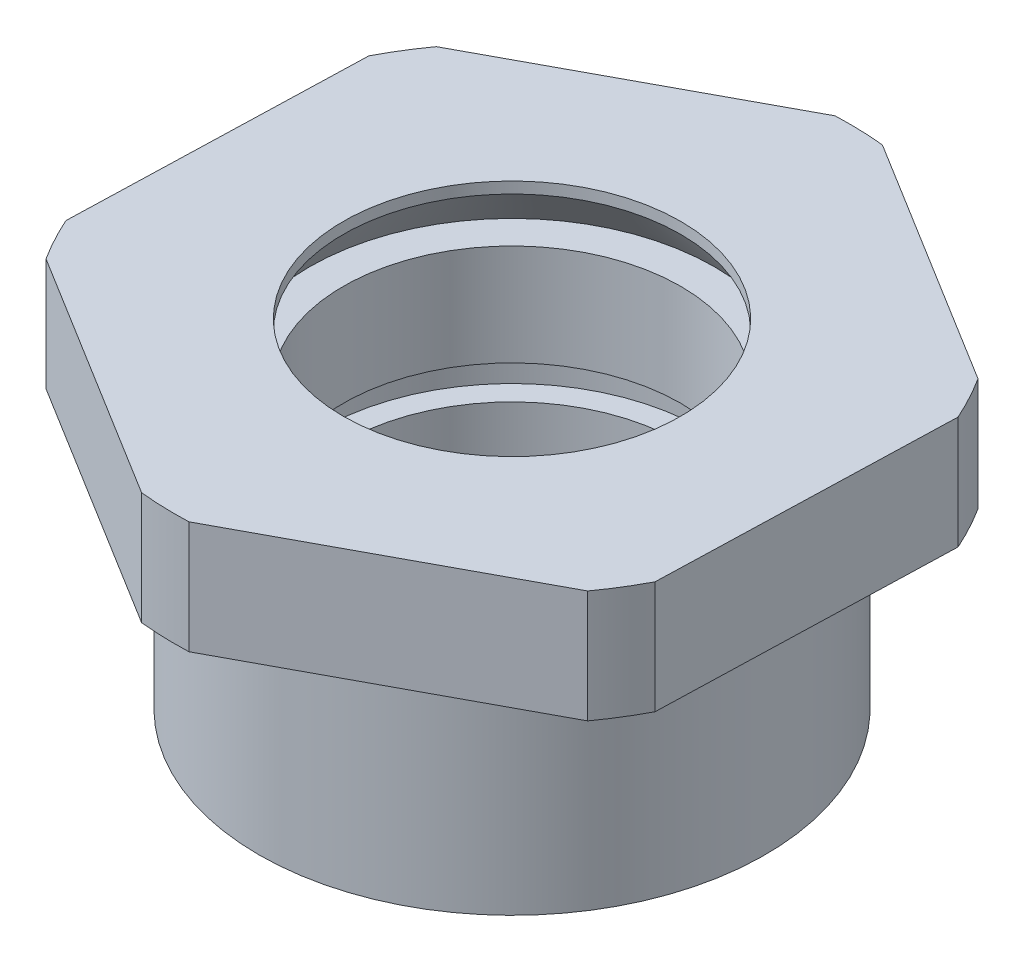
ISO-10303-21;
HEADER;
FILE_DESCRIPTION(('STEP AP214'),'2;1');
FILE_NAME('part.step','',(''),(''),'','','');
FILE_SCHEMA(('AUTOMOTIVE_DESIGN { 1 0 10303 214 1 1 1 1 }'));
ENDSEC;
DATA;
#1=APPLICATION_CONTEXT('core data for automotive mechanical design processes');
#2=APPLICATION_PROTOCOL_DEFINITION('international standard','automotive_design',2000,#1);
#3=PRODUCT_CONTEXT('',#1,'mechanical');
#4=PRODUCT('Part','Part','',(#3));
#5=PRODUCT_RELATED_PRODUCT_CATEGORY('part','',(#4));
#6=PRODUCT_DEFINITION_FORMATION('','',#4);
#7=PRODUCT_DEFINITION_CONTEXT('part definition',#1,'design');
#8=PRODUCT_DEFINITION('design','',#6,#7);
#9=PRODUCT_DEFINITION_SHAPE('','',#8);
#10=(LENGTH_UNIT() NAMED_UNIT(*) SI_UNIT(.MILLI.,.METRE.));
#11=(NAMED_UNIT(*) PLANE_ANGLE_UNIT() SI_UNIT($,.RADIAN.));
#12=(NAMED_UNIT(*) SI_UNIT($,.STERADIAN.) SOLID_ANGLE_UNIT());
#13=UNCERTAINTY_MEASURE_WITH_UNIT(LENGTH_MEASURE(1.E-05),#10,'distance_accuracy_value','');
#14=(GEOMETRIC_REPRESENTATION_CONTEXT(3) GLOBAL_UNCERTAINTY_ASSIGNED_CONTEXT((#13)) GLOBAL_UNIT_ASSIGNED_CONTEXT((#10,
#11,#12)) REPRESENTATION_CONTEXT('',''));
#15=CARTESIAN_POINT('',(0.,0.,0.));
#16=DIRECTION('',(0.,0.,1.));
#17=DIRECTION('',(1.,0.,0.));
#18=AXIS2_PLACEMENT_3D('',#15,#16,#17);
#19=CARTESIAN_POINT('',(21.,20.,0.));
#20=DIRECTION('',(0.,1.,0.));
#21=DIRECTION('',(0.,0.,1.));
#22=AXIS2_PLACEMENT_3D('',#19,#20,#21);
#23=PLANE('',#22);
#24=CARTESIAN_POINT('',(0.,20.,0.));
#25=DIRECTION('',(0.,1.,0.));
#26=DIRECTION('',(0.,0.,1.));
#27=AXIS2_PLACEMENT_3D('',#24,#25,#26);
#28=CIRCLE('',#27,21.);
#29=CARTESIAN_POINT('',(0.,20.,21.));
#30=VERTEX_POINT('',#29);
#31=EDGE_CURVE('E178',#30,#30,#28,.T.);
#32=ORIENTED_EDGE('',*,*,#31,.T.);
#33=EDGE_LOOP('',(#32));
#34=FACE_BOUND('',#33,.T.);
#35=DIRECTION('',(-0.850622977748023,0.,-0.525776140317423));
#36=VECTOR('',#35,1.);
#37=CARTESIAN_POINT('',(29.3907042443016,20.,-13.5748378109776));
#38=LINE('',#37,#36);
#39=CARTESIAN_POINT('',(25.3192945857422,20.,-16.0914052114911));
#40=VERTEX_POINT('',#39);
#41=CARTESIAN_POINT('',(3.07261699139862,20.,-29.8422355869021));
#42=VERTEX_POINT('',#41);
#43=EDGE_CURVE('E240',#40,#42,#38,.T.);
#44=ORIENTED_EDGE('',*,*,#43,.F.);
#45=CARTESIAN_POINT('',(0.,20.,0.));
#46=DIRECTION('',(0.,1.,0.));
#47=DIRECTION('',(0.,0.,1.));
#48=AXIS2_PLACEMENT_3D('',#45,#46,#47);
#49=CIRCLE('',#48,30.);
#50=CARTESIAN_POINT('',(27.3804426196766,20.,-12.2601534228002));
#51=VERTEX_POINT('',#50);
#52=EDGE_CURVE('E230',#51,#40,#49,.T.);
#53=ORIENTED_EDGE('',*,*,#52,.F.);
#54=DIRECTION('',(0.0300240053446084,0.,-0.999549177931265));
#55=VECTOR('',#54,1.);
#56=CARTESIAN_POINT('',(27.0067580629797,20.,0.180428277235875));
#57=LINE('',#56,#55);
#58=CARTESIAN_POINT('',(26.5952129886117,20.,13.881449711409));
#59=VERTEX_POINT('',#58);
#60=EDGE_CURVE('E218',#59,#51,#57,.T.);
#61=ORIENTED_EDGE('',*,*,#60,.F.);
#62=CARTESIAN_POINT('',(24.3078256282779,20.,17.582082164102));
#63=VERTEX_POINT('',#62);
#64=EDGE_CURVE('E177',#63,#59,#49,.T.);
#65=ORIENTED_EDGE('',*,*,#64,.F.);
#66=DIRECTION('',(0.880646983092632,0.,-0.473773037613842));
#67=VECTOR('',#66,1.);
#68=CARTESIAN_POINT('',(29.078193301007,20.,15.0157058223506));
#69=LINE('',#68,#67);
#70=CARTESIAN_POINT('',(1.2759184028695,20.,29.9728549229001));
#71=VERTEX_POINT('',#70);
#72=EDGE_CURVE('E638',#71,#63,#69,.T.);
#73=ORIENTED_EDGE('',*,*,#72,.F.);
#74=CARTESIAN_POINT('',(-3.0726169913986,20.,29.8422355869021));
#75=VERTEX_POINT('',#74);
#76=EDGE_CURVE('E172',#75,#71,#49,.T.);
#77=ORIENTED_EDGE('',*,*,#76,.F.);
#78=DIRECTION('',(0.850622977748023,0.,0.525776140317423));
#79=VECTOR('',#78,1.);
#80=CARTESIAN_POINT('',(0.998792667160769,20.,32.3588029874157));
#81=LINE('',#80,#79);
#82=CARTESIAN_POINT('',(-25.3192945857423,20.,16.0914052114911));
#83=VERTEX_POINT('',#82);
#84=EDGE_CURVE('E612',#83,#75,#81,.T.);
#85=ORIENTED_EDGE('',*,*,#84,.F.);
#86=CARTESIAN_POINT('',(-27.3804426196766,20.,12.2601534228002));
#87=VERTEX_POINT('',#86);
#88=EDGE_CURVE('E176',#87,#83,#49,.T.);
#89=ORIENTED_EDGE('',*,*,#88,.F.);
#90=DIRECTION('',(-0.030024005344608,0.,0.999549177931265));
#91=VECTOR('',#90,1.);
#92=CARTESIAN_POINT('',(-26.9688975453086,20.,-1.44086801137296));
#93=LINE('',#92,#91);
#94=CARTESIAN_POINT('',(-26.5952129886117,20.,-13.881449711409));
#95=VERTEX_POINT('',#94);
#96=EDGE_CURVE('E621',#95,#87,#93,.T.);
#97=ORIENTED_EDGE('',*,*,#96,.F.);
#98=CARTESIAN_POINT('',(-24.307825628278,20.,-17.582082164102));
#99=VERTEX_POINT('',#98);
#100=EDGE_CURVE('E226',#99,#95,#49,.T.);
#101=ORIENTED_EDGE('',*,*,#100,.F.);
#102=DIRECTION('',(-0.880646983092631,0.,0.473773037613842));
#103=VECTOR('',#102,1.);
#104=CARTESIAN_POINT('',(3.4944492698595,20.,-32.5392312646515));
#105=LINE('',#104,#103);
#106=CARTESIAN_POINT('',(-1.2759184028695,20.,-29.9728549229001));
#107=VERTEX_POINT('',#106);
#108=EDGE_CURVE('E152',#107,#99,#105,.T.);
#109=ORIENTED_EDGE('',*,*,#108,.F.);
#110=EDGE_CURVE('E150',#42,#107,#49,.T.);
#111=ORIENTED_EDGE('',*,*,#110,.F.);
#112=EDGE_LOOP('',(#44,#53,#61,#65,#73,#77,#85,#89,#97,#101,#109,#111));
#113=FACE_BOUND('',#112,.T.);
#114=ADVANCED_FACE('F40',(#34,#113),#23,.F.);
#115=CARTESIAN_POINT('',(0.,16.3064516129032,0.));
#116=DIRECTION('',(0.,1.,0.));
#117=DIRECTION('',(0.,0.,1.));
#118=AXIS2_PLACEMENT_3D('',#115,#116,#117);
#119=CYLINDRICAL_SURFACE('',#118,30.);
#120=DIRECTION('',(0.,1.,0.));
#121=VECTOR('',#120,1.);
#122=CARTESIAN_POINT('',(3.0726169913986,16.3064516129032,-29.8422355869021));
#123=LINE('',#122,#121);
#124=CARTESIAN_POINT('',(3.07261699139862,30.,-29.8422355869021));
#125=VERTEX_POINT('',#124);
#126=EDGE_CURVE('E243',#42,#125,#123,.T.);
#127=ORIENTED_EDGE('',*,*,#126,.F.);
#128=ORIENTED_EDGE('',*,*,#110,.T.);
#129=DIRECTION('',(0.,1.,0.));
#130=VECTOR('',#129,1.);
#131=CARTESIAN_POINT('',(-1.2759184028695,16.3064516129032,-29.9728549229001));
#132=LINE('',#131,#130);
#133=CARTESIAN_POINT('',(-1.27591840286949,30.,-29.9728549229001));
#134=VERTEX_POINT('',#133);
#135=EDGE_CURVE('E131',#134,#107,#132,.F.);
#136=ORIENTED_EDGE('',*,*,#135,.F.);
#137=CARTESIAN_POINT('',(0.,30.,0.));
#138=DIRECTION('',(0.,1.,0.));
#139=DIRECTION('',(0.,0.,1.));
#140=AXIS2_PLACEMENT_3D('',#137,#138,#139);
#141=CIRCLE('',#140,30.);
#142=EDGE_CURVE('E148',#125,#134,#141,.T.);
#143=ORIENTED_EDGE('',*,*,#142,.F.);
#144=EDGE_LOOP('',(#127,#128,#136,#143));
#145=FACE_BOUND('',#144,.T.);
#146=ADVANCED_FACE('F147',(#145),#119,.T.);
#147=DIRECTION('',(0.,1.,0.));
#148=VECTOR('',#147,1.);
#149=CARTESIAN_POINT('',(25.3192945857422,16.3064516129032,-16.0914052114911));
#150=LINE('',#149,#148);
#151=CARTESIAN_POINT('',(25.3192945857422,30.,-16.0914052114911));
#152=VERTEX_POINT('',#151);
#153=EDGE_CURVE('E237',#152,#40,#150,.F.);
#154=ORIENTED_EDGE('',*,*,#153,.F.);
#155=CARTESIAN_POINT('',(27.3804426196766,30.,-12.2601534228002));
#156=VERTEX_POINT('',#155);
#157=EDGE_CURVE('E158',#156,#152,#141,.T.);
#158=ORIENTED_EDGE('',*,*,#157,.F.);
#159=DIRECTION('',(0.,1.,0.));
#160=VECTOR('',#159,1.);
#161=CARTESIAN_POINT('',(27.3804426196766,16.3064516129032,-12.2601534228002));
#162=LINE('',#161,#160);
#163=EDGE_CURVE('E208',#51,#156,#162,.T.);
#164=ORIENTED_EDGE('',*,*,#163,.F.);
#165=ORIENTED_EDGE('',*,*,#52,.T.);
#166=EDGE_LOOP('',(#154,#158,#164,#165));
#167=FACE_BOUND('',#166,.T.);
#168=ADVANCED_FACE('F236',(#167),#119,.T.);
#169=DIRECTION('',(0.,1.,0.));
#170=VECTOR('',#169,1.);
#171=CARTESIAN_POINT('',(26.5952129886117,16.3064516129032,13.881449711409));
#172=LINE('',#171,#170);
#173=CARTESIAN_POINT('',(26.5952129886117,30.,13.881449711409));
#174=VERTEX_POINT('',#173);
#175=EDGE_CURVE('E205',#174,#59,#172,.F.);
#176=ORIENTED_EDGE('',*,*,#175,.F.);
#177=CARTESIAN_POINT('',(24.3078256282779,30.,17.582082164102));
#178=VERTEX_POINT('',#177);
#179=EDGE_CURVE('E163',#178,#174,#141,.T.);
#180=ORIENTED_EDGE('',*,*,#179,.F.);
#181=DIRECTION('',(0.,1.,0.));
#182=VECTOR('',#181,1.);
#183=CARTESIAN_POINT('',(24.307825628278,16.3064516129032,17.582082164102));
#184=LINE('',#183,#182);
#185=EDGE_CURVE('E219',#63,#178,#184,.T.);
#186=ORIENTED_EDGE('',*,*,#185,.F.);
#187=ORIENTED_EDGE('',*,*,#64,.T.);
#188=EDGE_LOOP('',(#176,#180,#186,#187));
#189=FACE_BOUND('',#188,.T.);
#190=ADVANCED_FACE('F214',(#189),#119,.T.);
#191=DIRECTION('',(0.,1.,0.));
#192=VECTOR('',#191,1.);
#193=CARTESIAN_POINT('',(1.2759184028695,16.3064516129032,29.9728549229001));
#194=LINE('',#193,#192);
#195=CARTESIAN_POINT('',(1.27591840286952,30.,29.9728549229001));
#196=VERTEX_POINT('',#195);
#197=EDGE_CURVE('E635',#196,#71,#194,.F.);
#198=ORIENTED_EDGE('',*,*,#197,.F.);
#199=CARTESIAN_POINT('',(-3.07261699139861,30.,29.8422355869021));
#200=VERTEX_POINT('',#199);
#201=EDGE_CURVE('E165',#200,#196,#141,.T.);
#202=ORIENTED_EDGE('',*,*,#201,.F.);
#203=DIRECTION('',(0.,1.,0.));
#204=VECTOR('',#203,1.);
#205=CARTESIAN_POINT('',(-3.07261699139856,16.3064516129032,29.8422355869021));
#206=LINE('',#205,#204);
#207=EDGE_CURVE('E56',#75,#200,#206,.T.);
#208=ORIENTED_EDGE('',*,*,#207,.F.);
#209=ORIENTED_EDGE('',*,*,#76,.T.);
#210=EDGE_LOOP('',(#198,#202,#208,#209));
#211=FACE_BOUND('',#210,.T.);
#212=ADVANCED_FACE('F481',(#211),#119,.T.);
#213=DIRECTION('',(0.,1.,0.));
#214=VECTOR('',#213,1.);
#215=CARTESIAN_POINT('',(-25.3192945857423,16.3064516129032,16.0914052114911));
#216=LINE('',#215,#214);
#217=CARTESIAN_POINT('',(-25.3192945857422,30.,16.0914052114911));
#218=VERTEX_POINT('',#217);
#219=EDGE_CURVE('E607',#218,#83,#216,.F.);
#220=ORIENTED_EDGE('',*,*,#219,.F.);
#221=CARTESIAN_POINT('',(-27.3804426196766,30.,12.2601534228002));
#222=VERTEX_POINT('',#221);
#223=EDGE_CURVE('E164',#222,#218,#141,.T.);
#224=ORIENTED_EDGE('',*,*,#223,.F.);
#225=DIRECTION('',(0.,1.,0.));
#226=VECTOR('',#225,1.);
#227=CARTESIAN_POINT('',(-27.3804426196766,16.3064516129032,12.2601534228002));
#228=LINE('',#227,#226);
#229=EDGE_CURVE('E64',#87,#222,#228,.T.);
#230=ORIENTED_EDGE('',*,*,#229,.F.);
#231=ORIENTED_EDGE('',*,*,#88,.T.);
#232=EDGE_LOOP('',(#220,#224,#230,#231));
#233=FACE_BOUND('',#232,.T.);
#234=ADVANCED_FACE('F314',(#233),#119,.T.);
#235=DIRECTION('',(0.,1.,0.));
#236=VECTOR('',#235,1.);
#237=CARTESIAN_POINT('',(-26.5952129886117,16.3064516129032,-13.881449711409));
#238=LINE('',#237,#236);
#239=CARTESIAN_POINT('',(-26.5952129886117,30.,-13.881449711409));
#240=VERTEX_POINT('',#239);
#241=EDGE_CURVE('E617',#240,#95,#238,.F.);
#242=ORIENTED_EDGE('',*,*,#241,.F.);
#243=CARTESIAN_POINT('',(-24.307825628278,30.,-17.582082164102));
#244=VERTEX_POINT('',#243);
#245=EDGE_CURVE('E159',#244,#240,#141,.T.);
#246=ORIENTED_EDGE('',*,*,#245,.F.);
#247=DIRECTION('',(0.,1.,0.));
#248=VECTOR('',#247,1.);
#249=CARTESIAN_POINT('',(-24.307825628278,16.3064516129032,-17.582082164102));
#250=LINE('',#249,#248);
#251=EDGE_CURVE('E134',#99,#244,#250,.T.);
#252=ORIENTED_EDGE('',*,*,#251,.F.);
#253=ORIENTED_EDGE('',*,*,#100,.T.);
#254=EDGE_LOOP('',(#242,#246,#252,#253));
#255=FACE_BOUND('',#254,.T.);
#256=ADVANCED_FACE('F306',(#255),#119,.T.);
#257=CARTESIAN_POINT('',(30.,30.,0.));
#258=DIRECTION('',(0.,-1.,0.));
#259=DIRECTION('',(0.,0.,-1.));
#260=AXIS2_PLACEMENT_3D('',#257,#258,#259);
#261=PLANE('',#260);
#262=CARTESIAN_POINT('',(0.,30.,0.));
#263=DIRECTION('',(0.,1.,0.));
#264=DIRECTION('',(0.,0.,1.));
#265=AXIS2_PLACEMENT_3D('',#262,#263,#264);
#266=CIRCLE('',#265,15.);
#267=CARTESIAN_POINT('',(0.,30.,15.));
#268=VERTEX_POINT('',#267);
#269=EDGE_CURVE('E170',#268,#268,#266,.T.);
#270=ORIENTED_EDGE('',*,*,#269,.F.);
#271=EDGE_LOOP('',(#270));
#272=FACE_BOUND('',#271,.T.);
#273=DIRECTION('',(0.850622977748023,0.,0.525776140317423));
#274=VECTOR('',#273,1.);
#275=CARTESIAN_POINT('',(35.9027392967578,30.,-9.54970241602658));
#276=LINE('',#275,#274);
#277=EDGE_CURVE('E12',#125,#152,#276,.T.);
#278=ORIENTED_EDGE('',*,*,#277,.F.);
#279=ORIENTED_EDGE('',*,*,#142,.T.);
#280=DIRECTION('',(0.880646983092631,0.,-0.473773037613842));
#281=VECTOR('',#280,1.);
#282=CARTESIAN_POINT('',(10.4743012493309,30.,-36.2942724308589));
#283=LINE('',#282,#281);
#284=EDGE_CURVE('E128',#244,#134,#283,.T.);
#285=ORIENTED_EDGE('',*,*,#284,.F.);
#286=ORIENTED_EDGE('',*,*,#245,.T.);
#287=DIRECTION('',(0.030024005344608,0.,-0.999549177931265));
#288=VECTOR('',#287,1.);
#289=CARTESIAN_POINT('',(-26.9607845772362,30.,-1.71096224011662));
#290=LINE('',#289,#288);
#291=EDGE_CURVE('E140',#222,#240,#290,.T.);
#292=ORIENTED_EDGE('',*,*,#291,.F.);
#293=ORIENTED_EDGE('',*,*,#223,.T.);
#294=DIRECTION('',(-0.850622977748023,0.,-0.525776140317423));
#295=VECTOR('',#294,1.);
#296=CARTESIAN_POINT('',(7.51082771961699,30.,36.3839383823667));
#297=LINE('',#296,#295);
#298=EDGE_CURVE('E195',#200,#218,#297,.T.);
#299=ORIENTED_EDGE('',*,*,#298,.F.);
#300=ORIENTED_EDGE('',*,*,#201,.T.);
#301=DIRECTION('',(-0.880646983092632,0.,0.473773037613842));
#302=VECTOR('',#301,1.);
#303=CARTESIAN_POINT('',(36.0580452804783,30.,11.2606646561432));
#304=LINE('',#303,#302);
#305=EDGE_CURVE('E198',#178,#196,#304,.T.);
#306=ORIENTED_EDGE('',*,*,#305,.F.);
#307=ORIENTED_EDGE('',*,*,#179,.T.);
#308=DIRECTION('',(-0.0300240053446084,0.,0.999549177931265));
#309=VECTOR('',#308,1.);
#310=CARTESIAN_POINT('',(27.0148710310521,30.,-0.0896659515077894));
#311=LINE('',#310,#309);
#312=EDGE_CURVE('E49',#156,#174,#311,.T.);
#313=ORIENTED_EDGE('',*,*,#312,.F.);
#314=ORIENTED_EDGE('',*,*,#157,.T.);
#315=EDGE_LOOP('',(#278,#279,#285,#286,#292,#293,#299,#300,#306,#307,#313,#314));
#316=FACE_BOUND('',#315,.T.);
#317=ADVANCED_FACE('F155',(#272,#316),#261,.F.);
#318=CARTESIAN_POINT('',(15.,0.,0.));
#319=DIRECTION('',(0.,1.,0.));
#320=DIRECTION('',(0.,0.,1.));
#321=AXIS2_PLACEMENT_3D('',#318,#319,#320);
#322=PLANE('',#321);
#323=CARTESIAN_POINT('',(0.,0.,0.));
#324=DIRECTION('',(0.,1.,0.));
#325=DIRECTION('',(0.,0.,1.));
#326=AXIS2_PLACEMENT_3D('',#323,#324,#325);
#327=CIRCLE('',#326,22.5);
#328=CARTESIAN_POINT('',(0.,0.,22.5));
#329=VERTEX_POINT('',#328);
#330=EDGE_CURVE('E141',#329,#329,#327,.T.);
#331=ORIENTED_EDGE('',*,*,#330,.F.);
#332=EDGE_LOOP('',(#331));
#333=FACE_BOUND('',#332,.T.);
#334=CARTESIAN_POINT('',(0.,0.,0.));
#335=DIRECTION('',(0.,1.,0.));
#336=DIRECTION('',(0.,0.,1.));
#337=AXIS2_PLACEMENT_3D('',#334,#335,#336);
#338=CIRCLE('',#337,15.);
#339=CARTESIAN_POINT('',(0.,0.,15.));
#340=VERTEX_POINT('',#339);
#341=EDGE_CURVE('E247',#340,#340,#338,.T.);
#342=ORIENTED_EDGE('',*,*,#341,.T.);
#343=EDGE_LOOP('',(#342));
#344=FACE_BOUND('',#343,.T.);
#345=ADVANCED_FACE('F42',(#333,#344),#322,.F.);
#346=CARTESIAN_POINT('',(0.,16.3064516129032,0.));
#347=DIRECTION('',(0.,1.,0.));
#348=DIRECTION('',(0.,0.,1.));
#349=AXIS2_PLACEMENT_3D('',#346,#347,#348);
#350=CYLINDRICAL_SURFACE('',#349,22.5);
#351=CARTESIAN_POINT('',(0.,17.,0.));
#352=DIRECTION('',(0.,1.,0.));
#353=DIRECTION('',(0.,0.,1.));
#354=AXIS2_PLACEMENT_3D('',#351,#352,#353);
#355=CIRCLE('',#354,22.5);
#356=CARTESIAN_POINT('',(0.,17.,22.5));
#357=VERTEX_POINT('',#356);
#358=EDGE_CURVE('E186',#357,#357,#355,.T.);
#359=ORIENTED_EDGE('',*,*,#358,.F.);
#360=EDGE_LOOP('',(#359));
#361=FACE_BOUND('',#360,.T.);
#362=ORIENTED_EDGE('',*,*,#330,.T.);
#363=EDGE_LOOP('',(#362));
#364=FACE_BOUND('',#363,.T.);
#365=ADVANCED_FACE('F312',(#361,#364),#350,.T.);
#366=CARTESIAN_POINT('',(22.5,17.,0.));
#367=DIRECTION('',(0.,-1.,0.));
#368=DIRECTION('',(0.,0.,-1.));
#369=AXIS2_PLACEMENT_3D('',#366,#367,#368);
#370=PLANE('',#369);
#371=CARTESIAN_POINT('',(0.,17.,0.));
#372=DIRECTION('',(0.,1.,0.));
#373=DIRECTION('',(0.,0.,1.));
#374=AXIS2_PLACEMENT_3D('',#371,#372,#373);
#375=CIRCLE('',#374,21.);
#376=CARTESIAN_POINT('',(0.,17.,21.));
#377=VERTEX_POINT('',#376);
#378=EDGE_CURVE('E182',#377,#377,#375,.T.);
#379=ORIENTED_EDGE('',*,*,#378,.F.);
#380=EDGE_LOOP('',(#379));
#381=FACE_BOUND('',#380,.T.);
#382=ORIENTED_EDGE('',*,*,#358,.T.);
#383=EDGE_LOOP('',(#382));
#384=FACE_BOUND('',#383,.T.);
#385=ADVANCED_FACE('F328',(#381,#384),#370,.F.);
#386=CARTESIAN_POINT('',(0.,16.3064516129032,0.));
#387=DIRECTION('',(0.,1.,0.));
#388=DIRECTION('',(0.,0.,1.));
#389=AXIS2_PLACEMENT_3D('',#386,#387,#388);
#390=CYLINDRICAL_SURFACE('',#389,21.);
#391=ORIENTED_EDGE('',*,*,#31,.F.);
#392=EDGE_LOOP('',(#391));
#393=FACE_BOUND('',#392,.T.);
#394=ORIENTED_EDGE('',*,*,#378,.T.);
#395=EDGE_LOOP('',(#394));
#396=FACE_BOUND('',#395,.T.);
#397=ADVANCED_FACE('F325',(#393,#396),#390,.T.);
#398=CARTESIAN_POINT('',(0.,16.3064516129032,0.));
#399=DIRECTION('',(0.,1.,0.));
#400=DIRECTION('',(0.,0.,1.));
#401=AXIS2_PLACEMENT_3D('',#398,#399,#400);
#402=CYLINDRICAL_SURFACE('',#401,15.);
#403=CARTESIAN_POINT('',(0.,29.,0.));
#404=DIRECTION('',(0.,1.,0.));
#405=DIRECTION('',(0.,0.,1.));
#406=AXIS2_PLACEMENT_3D('',#403,#404,#405);
#407=CIRCLE('',#406,15.);
#408=CARTESIAN_POINT('',(0.,29.,15.));
#409=VERTEX_POINT('',#408);
#410=EDGE_CURVE('E294',#409,#409,#407,.T.);
#411=ORIENTED_EDGE('',*,*,#410,.F.);
#412=EDGE_LOOP('',(#411));
#413=FACE_BOUND('',#412,.T.);
#414=ORIENTED_EDGE('',*,*,#269,.T.);
#415=EDGE_LOOP('',(#414));
#416=FACE_BOUND('',#415,.T.);
#417=ADVANCED_FACE('F303',(#413,#416),#402,.F.);
#418=CARTESIAN_POINT('',(0.,29.,0.));
#419=DIRECTION('',(0.,-1.,0.));
#420=DIRECTION('',(0.,0.,-1.));
#421=AXIS2_PLACEMENT_3D('',#418,#419,#420);
#422=CONICAL_SURFACE('',#421,15.,0.643501108793284);
#423=CARTESIAN_POINT('',(0.,25.,0.));
#424=DIRECTION('',(0.,1.,0.));
#425=DIRECTION('',(0.,0.,1.));
#426=AXIS2_PLACEMENT_3D('',#423,#424,#425);
#427=CIRCLE('',#426,18.);
#428=CARTESIAN_POINT('',(0.,25.,18.));
#429=VERTEX_POINT('',#428);
#430=EDGE_CURVE('E291',#429,#429,#427,.T.);
#431=ORIENTED_EDGE('',*,*,#430,.F.);
#432=EDGE_LOOP('',(#431));
#433=FACE_BOUND('',#432,.T.);
#434=ORIENTED_EDGE('',*,*,#410,.T.);
#435=EDGE_LOOP('',(#434));
#436=FACE_BOUND('',#435,.T.);
#437=ADVANCED_FACE('F399',(#433,#436),#422,.F.);
#438=CARTESIAN_POINT('',(18.,25.,0.));
#439=DIRECTION('',(0.,-1.,0.));
#440=DIRECTION('',(0.,0.,-1.));
#441=AXIS2_PLACEMENT_3D('',#438,#439,#440);
#442=PLANE('',#441);
#443=CARTESIAN_POINT('',(0.,25.,0.));
#444=DIRECTION('',(0.,1.,0.));
#445=DIRECTION('',(0.,0.,1.));
#446=AXIS2_PLACEMENT_3D('',#443,#444,#445);
#447=CIRCLE('',#446,15.);
#448=CARTESIAN_POINT('',(0.,25.,15.));
#449=VERTEX_POINT('',#448);
#450=EDGE_CURVE('E287',#449,#449,#447,.T.);
#451=ORIENTED_EDGE('',*,*,#450,.F.);
#452=EDGE_LOOP('',(#451));
#453=FACE_BOUND('',#452,.T.);
#454=ORIENTED_EDGE('',*,*,#430,.T.);
#455=EDGE_LOOP('',(#454));
#456=FACE_BOUND('',#455,.T.);
#457=ADVANCED_FACE('F393',(#453,#456),#442,.F.);
#458=CARTESIAN_POINT('',(0.,16.3064516129032,0.));
#459=DIRECTION('',(0.,1.,0.));
#460=DIRECTION('',(0.,0.,1.));
#461=AXIS2_PLACEMENT_3D('',#458,#459,#460);
#462=CYLINDRICAL_SURFACE('',#461,15.);
#463=CARTESIAN_POINT('',(0.,16.,0.));
#464=DIRECTION('',(0.,1.,0.));
#465=DIRECTION('',(0.,0.,1.));
#466=AXIS2_PLACEMENT_3D('',#463,#464,#465);
#467=CIRCLE('',#466,15.);
#468=CARTESIAN_POINT('',(0.,16.,15.));
#469=VERTEX_POINT('',#468);
#470=EDGE_CURVE('E283',#469,#469,#467,.T.);
#471=ORIENTED_EDGE('',*,*,#470,.F.);
#472=EDGE_LOOP('',(#471));
#473=FACE_BOUND('',#472,.T.);
#474=ORIENTED_EDGE('',*,*,#450,.T.);
#475=EDGE_LOOP('',(#474));
#476=FACE_BOUND('',#475,.T.);
#477=ADVANCED_FACE('F387',(#473,#476),#462,.F.);
#478=CARTESIAN_POINT('',(17.,16.,0.));
#479=DIRECTION('',(0.,1.,0.));
#480=DIRECTION('',(0.,0.,1.));
#481=AXIS2_PLACEMENT_3D('',#478,#479,#480);
#482=PLANE('',#481);
#483=CARTESIAN_POINT('',(0.,16.,0.));
#484=DIRECTION('',(0.,1.,0.));
#485=DIRECTION('',(0.,0.,1.));
#486=AXIS2_PLACEMENT_3D('',#483,#484,#485);
#487=CIRCLE('',#486,17.);
#488=CARTESIAN_POINT('',(0.,16.,17.));
#489=VERTEX_POINT('',#488);
#490=EDGE_CURVE('E279',#489,#489,#487,.T.);
#491=ORIENTED_EDGE('',*,*,#490,.F.);
#492=EDGE_LOOP('',(#491));
#493=FACE_BOUND('',#492,.T.);
#494=ORIENTED_EDGE('',*,*,#470,.T.);
#495=EDGE_LOOP('',(#494));
#496=FACE_BOUND('',#495,.T.);
#497=ADVANCED_FACE('F381',(#493,#496),#482,.F.);
#498=CARTESIAN_POINT('',(0.,16.3064516129032,0.));
#499=DIRECTION('',(0.,1.,0.));
#500=DIRECTION('',(0.,0.,1.));
#501=AXIS2_PLACEMENT_3D('',#498,#499,#500);
#502=CYLINDRICAL_SURFACE('',#501,17.);
#503=CARTESIAN_POINT('',(0.,13.,0.));
#504=DIRECTION('',(0.,1.,0.));
#505=DIRECTION('',(0.,0.,1.));
#506=AXIS2_PLACEMENT_3D('',#503,#504,#505);
#507=CIRCLE('',#506,17.);
#508=CARTESIAN_POINT('',(0.,13.,17.));
#509=VERTEX_POINT('',#508);
#510=EDGE_CURVE('E275',#509,#509,#507,.T.);
#511=ORIENTED_EDGE('',*,*,#510,.F.);
#512=EDGE_LOOP('',(#511));
#513=FACE_BOUND('',#512,.T.);
#514=ORIENTED_EDGE('',*,*,#490,.T.);
#515=EDGE_LOOP('',(#514));
#516=FACE_BOUND('',#515,.T.);
#517=ADVANCED_FACE('F375',(#513,#516),#502,.F.);
#518=CARTESIAN_POINT('',(17.,13.,0.));
#519=DIRECTION('',(0.,-1.,0.));
#520=DIRECTION('',(0.,0.,-1.));
#521=AXIS2_PLACEMENT_3D('',#518,#519,#520);
#522=PLANE('',#521);
#523=CARTESIAN_POINT('',(0.,13.,0.));
#524=DIRECTION('',(0.,1.,0.));
#525=DIRECTION('',(0.,0.,1.));
#526=AXIS2_PLACEMENT_3D('',#523,#524,#525);
#527=CIRCLE('',#526,15.);
#528=CARTESIAN_POINT('',(0.,13.,15.));
#529=VERTEX_POINT('',#528);
#530=EDGE_CURVE('E271',#529,#529,#527,.T.);
#531=ORIENTED_EDGE('',*,*,#530,.F.);
#532=EDGE_LOOP('',(#531));
#533=FACE_BOUND('',#532,.T.);
#534=ORIENTED_EDGE('',*,*,#510,.T.);
#535=EDGE_LOOP('',(#534));
#536=FACE_BOUND('',#535,.T.);
#537=ADVANCED_FACE('F369',(#533,#536),#522,.F.);
#538=CARTESIAN_POINT('',(0.,16.3064516129032,0.));
#539=DIRECTION('',(0.,1.,0.));
#540=DIRECTION('',(0.,0.,1.));
#541=AXIS2_PLACEMENT_3D('',#538,#539,#540);
#542=CYLINDRICAL_SURFACE('',#541,15.);
#543=CARTESIAN_POINT('',(0.,8.,0.));
#544=DIRECTION('',(0.,1.,0.));
#545=DIRECTION('',(0.,0.,1.));
#546=AXIS2_PLACEMENT_3D('',#543,#544,#545);
#547=CIRCLE('',#546,15.);
#548=CARTESIAN_POINT('',(0.,8.,15.));
#549=VERTEX_POINT('',#548);
#550=EDGE_CURVE('E267',#549,#549,#547,.T.);
#551=ORIENTED_EDGE('',*,*,#550,.F.);
#552=EDGE_LOOP('',(#551));
#553=FACE_BOUND('',#552,.T.);
#554=ORIENTED_EDGE('',*,*,#530,.T.);
#555=EDGE_LOOP('',(#554));
#556=FACE_BOUND('',#555,.T.);
#557=ADVANCED_FACE('F363',(#553,#556),#542,.F.);
#558=CARTESIAN_POINT('',(15.,8.,0.));
#559=DIRECTION('',(0.,1.,0.));
#560=DIRECTION('',(0.,0.,1.));
#561=AXIS2_PLACEMENT_3D('',#558,#559,#560);
#562=PLANE('',#561);
#563=CARTESIAN_POINT('',(0.,8.,0.));
#564=DIRECTION('',(0.,1.,0.));
#565=DIRECTION('',(0.,0.,1.));
#566=AXIS2_PLACEMENT_3D('',#563,#564,#565);
#567=CIRCLE('',#566,17.);
#568=CARTESIAN_POINT('',(0.,8.,17.));
#569=VERTEX_POINT('',#568);
#570=EDGE_CURVE('E263',#569,#569,#567,.T.);
#571=ORIENTED_EDGE('',*,*,#570,.F.);
#572=EDGE_LOOP('',(#571));
#573=FACE_BOUND('',#572,.T.);
#574=ORIENTED_EDGE('',*,*,#550,.T.);
#575=EDGE_LOOP('',(#574));
#576=FACE_BOUND('',#575,.T.);
#577=ADVANCED_FACE('F357',(#573,#576),#562,.F.);
#578=CARTESIAN_POINT('',(0.,16.3064516129032,0.));
#579=DIRECTION('',(0.,1.,0.));
#580=DIRECTION('',(0.,0.,1.));
#581=AXIS2_PLACEMENT_3D('',#578,#579,#580);
#582=CYLINDRICAL_SURFACE('',#581,17.);
#583=CARTESIAN_POINT('',(0.,5.,0.));
#584=DIRECTION('',(0.,1.,0.));
#585=DIRECTION('',(0.,0.,1.));
#586=AXIS2_PLACEMENT_3D('',#583,#584,#585);
#587=CIRCLE('',#586,17.);
#588=CARTESIAN_POINT('',(0.,5.,17.));
#589=VERTEX_POINT('',#588);
#590=EDGE_CURVE('E259',#589,#589,#587,.T.);
#591=ORIENTED_EDGE('',*,*,#590,.F.);
#592=EDGE_LOOP('',(#591));
#593=FACE_BOUND('',#592,.T.);
#594=ORIENTED_EDGE('',*,*,#570,.T.);
#595=EDGE_LOOP('',(#594));
#596=FACE_BOUND('',#595,.T.);
#597=ADVANCED_FACE('F351',(#593,#596),#582,.F.);
#598=CARTESIAN_POINT('',(17.,5.,0.));
#599=DIRECTION('',(0.,-1.,0.));
#600=DIRECTION('',(0.,0.,-1.));
#601=AXIS2_PLACEMENT_3D('',#598,#599,#600);
#602=PLANE('',#601);
#603=CARTESIAN_POINT('',(0.,5.,0.));
#604=DIRECTION('',(0.,1.,0.));
#605=DIRECTION('',(0.,0.,1.));
#606=AXIS2_PLACEMENT_3D('',#603,#604,#605);
#607=CIRCLE('',#606,15.);
#608=CARTESIAN_POINT('',(0.,5.,15.));
#609=VERTEX_POINT('',#608);
#610=EDGE_CURVE('E255',#609,#609,#607,.T.);
#611=ORIENTED_EDGE('',*,*,#610,.F.);
#612=EDGE_LOOP('',(#611));
#613=FACE_BOUND('',#612,.T.);
#614=ORIENTED_EDGE('',*,*,#590,.T.);
#615=EDGE_LOOP('',(#614));
#616=FACE_BOUND('',#615,.T.);
#617=ADVANCED_FACE('F345',(#613,#616),#602,.F.);
#618=CARTESIAN_POINT('',(0.,16.3064516129032,0.));
#619=DIRECTION('',(0.,1.,0.));
#620=DIRECTION('',(0.,0.,1.));
#621=AXIS2_PLACEMENT_3D('',#618,#619,#620);
#622=CYLINDRICAL_SURFACE('',#621,15.);
#623=ORIENTED_EDGE('',*,*,#341,.F.);
#624=EDGE_LOOP('',(#623));
#625=FACE_BOUND('',#624,.T.);
#626=ORIENTED_EDGE('',*,*,#610,.T.);
#627=EDGE_LOOP('',(#626));
#628=FACE_BOUND('',#627,.T.);
#629=ADVANCED_FACE('F342',(#625,#628),#622,.F.);
#630=CARTESIAN_POINT('',(0.936055848664467,0.,-31.1628592951318));
#631=DIRECTION('',(-0.473773037613842,0.,-0.880646983092631));
#632=DIRECTION('',(-0.880646983092631,0.,0.473773037613842));
#633=AXIS2_PLACEMENT_3D('',#630,#631,#632);
#634=PLANE('',#633);
#635=ORIENTED_EDGE('',*,*,#251,.T.);
#636=ORIENTED_EDGE('',*,*,#284,.T.);
#637=ORIENTED_EDGE('',*,*,#135,.T.);
#638=ORIENTED_EDGE('',*,*,#108,.T.);
#639=EDGE_LOOP('',(#635,#636,#637,#638));
#640=FACE_BOUND('',#639,.T.);
#641=ADVANCED_FACE('F130',(#640),#634,.T.);
#642=CARTESIAN_POINT('',(-26.5197998798119,0.,-16.3920777918703));
#643=DIRECTION('',(-0.999549177931265,0.,-0.0300240053446079));
#644=DIRECTION('',(-0.030024005344608,0.,0.999549177931265));
#645=AXIS2_PLACEMENT_3D('',#642,#643,#644);
#646=PLANE('',#645);
#647=ORIENTED_EDGE('',*,*,#229,.T.);
#648=ORIENTED_EDGE('',*,*,#291,.T.);
#649=ORIENTED_EDGE('',*,*,#241,.T.);
#650=ORIENTED_EDGE('',*,*,#96,.T.);
#651=EDGE_LOOP('',(#647,#648,#649,#650));
#652=FACE_BOUND('',#651,.T.);
#653=ADVANCED_FACE('F415',(#652),#646,.T.);
#654=CARTESIAN_POINT('',(-27.4558557284764,0.,14.7707815032615));
#655=DIRECTION('',(-0.525776140317423,0.,0.850622977748023));
#656=DIRECTION('',(0.850622977748023,0.,0.525776140317423));
#657=AXIS2_PLACEMENT_3D('',#654,#655,#656);
#658=PLANE('',#657);
#659=ORIENTED_EDGE('',*,*,#207,.T.);
#660=ORIENTED_EDGE('',*,*,#298,.T.);
#661=ORIENTED_EDGE('',*,*,#219,.T.);
#662=ORIENTED_EDGE('',*,*,#84,.T.);
#663=EDGE_LOOP('',(#659,#660,#661,#662));
#664=FACE_BOUND('',#663,.T.);
#665=ADVANCED_FACE('F418',(#664),#658,.T.);
#666=CARTESIAN_POINT('',(-0.936055848664439,0.,31.1628592951318));
#667=DIRECTION('',(0.473773037613842,0.,0.880646983092631));
#668=DIRECTION('',(0.880646983092632,0.,-0.473773037613842));
#669=AXIS2_PLACEMENT_3D('',#666,#667,#668);
#670=PLANE('',#669);
#671=ORIENTED_EDGE('',*,*,#185,.T.);
#672=ORIENTED_EDGE('',*,*,#305,.T.);
#673=ORIENTED_EDGE('',*,*,#197,.T.);
#674=ORIENTED_EDGE('',*,*,#72,.T.);
#675=EDGE_LOOP('',(#671,#672,#673,#674));
#676=FACE_BOUND('',#675,.T.);
#677=ADVANCED_FACE('F421',(#676),#670,.T.);
#678=CARTESIAN_POINT('',(26.5197998798119,0.,16.3920777918703));
#679=DIRECTION('',(0.999549177931265,0.,0.0300240053446084));
#680=DIRECTION('',(0.0300240053446084,0.,-0.999549177931265));
#681=AXIS2_PLACEMENT_3D('',#678,#679,#680);
#682=PLANE('',#681);
#683=ORIENTED_EDGE('',*,*,#163,.T.);
#684=ORIENTED_EDGE('',*,*,#312,.T.);
#685=ORIENTED_EDGE('',*,*,#175,.T.);
#686=ORIENTED_EDGE('',*,*,#60,.T.);
#687=EDGE_LOOP('',(#683,#684,#685,#686));
#688=FACE_BOUND('',#687,.T.);
#689=ADVANCED_FACE('F204',(#688),#682,.T.);
#690=CARTESIAN_POINT('',(27.4558557284764,0.,-14.7707815032615));
#691=DIRECTION('',(0.525776140317423,0.,-0.850622977748023));
#692=DIRECTION('',(-0.850622977748023,0.,-0.525776140317423));
#693=AXIS2_PLACEMENT_3D('',#690,#691,#692);
#694=PLANE('',#693);
#695=ORIENTED_EDGE('',*,*,#126,.T.);
#696=ORIENTED_EDGE('',*,*,#277,.T.);
#697=ORIENTED_EDGE('',*,*,#153,.T.);
#698=ORIENTED_EDGE('',*,*,#43,.T.);
#699=EDGE_LOOP('',(#695,#696,#697,#698));
#700=FACE_BOUND('',#699,.T.);
#701=ADVANCED_FACE('F410',(#700),#694,.T.);
#702=CLOSED_SHELL('',(#114,#146,#168,#190,#212,#234,#256,#317,#345,#365,#385,#397,#417,#437,
#457,#477,#497,#517,#537,#557,#577,#597,#617,#629,#641,#653,#665,#677,#689,#701));
#703=MANIFOLD_SOLID_BREP('B2',#702);
#704=ADVANCED_BREP_SHAPE_REPRESENTATION('',(#18,#703),#14);
#705=SHAPE_DEFINITION_REPRESENTATION(#9,#704);
ENDSEC;
END-ISO-10303-21;
